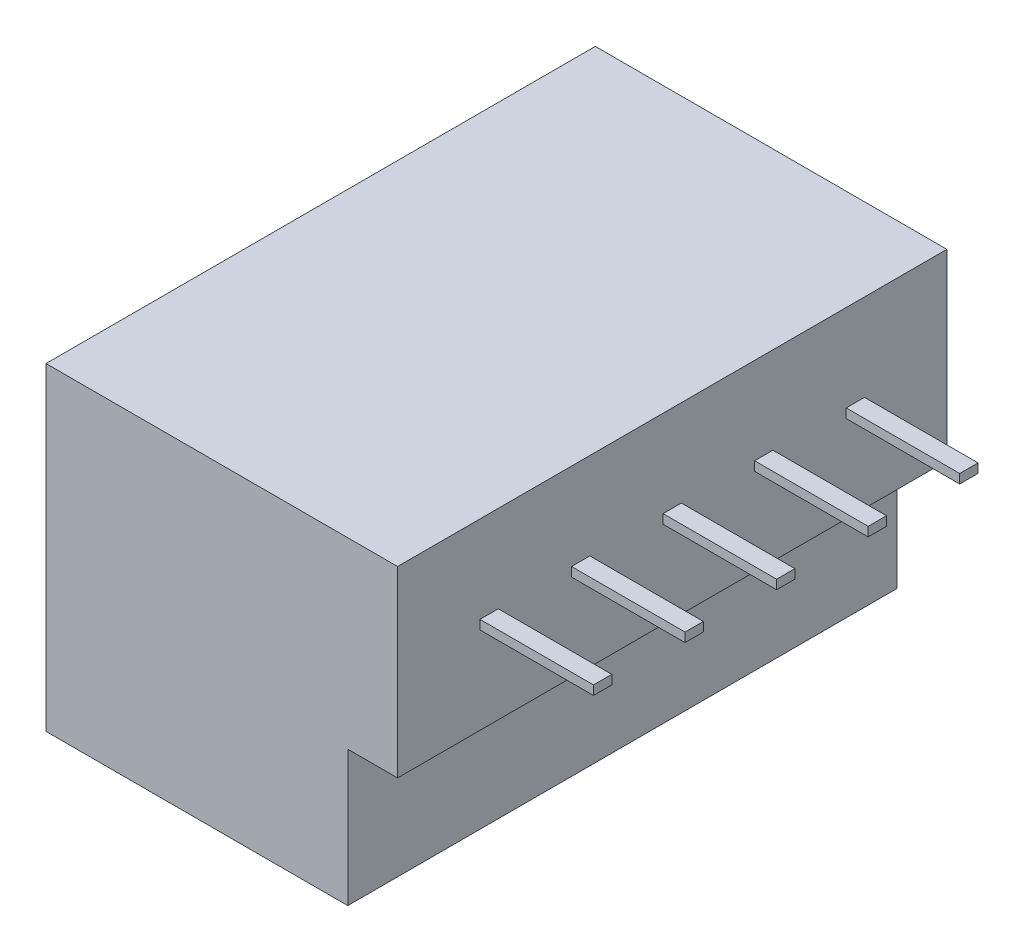
ISO-10303-21;
HEADER;
FILE_DESCRIPTION(('STEP AP214'),'2;1');
FILE_NAME('part.step','',(''),(''),'','','');
FILE_SCHEMA(('AUTOMOTIVE_DESIGN { 1 0 10303 214 1 1 1 1 }'));
ENDSEC;
DATA;
#1=APPLICATION_CONTEXT('core data for automotive mechanical design processes');
#2=APPLICATION_PROTOCOL_DEFINITION('international standard','automotive_design',2000,#1);
#3=PRODUCT_CONTEXT('',#1,'mechanical');
#4=PRODUCT('Part','Part','',(#3));
#5=PRODUCT_RELATED_PRODUCT_CATEGORY('part','',(#4));
#6=PRODUCT_DEFINITION_FORMATION('','',#4);
#7=PRODUCT_DEFINITION_CONTEXT('part definition',#1,'design');
#8=PRODUCT_DEFINITION('design','',#6,#7);
#9=PRODUCT_DEFINITION_SHAPE('','',#8);
#10=(LENGTH_UNIT() NAMED_UNIT(*) SI_UNIT(.MILLI.,.METRE.));
#11=(NAMED_UNIT(*) PLANE_ANGLE_UNIT() SI_UNIT($,.RADIAN.));
#12=(NAMED_UNIT(*) SI_UNIT($,.STERADIAN.) SOLID_ANGLE_UNIT());
#13=UNCERTAINTY_MEASURE_WITH_UNIT(LENGTH_MEASURE(1.E-05),#10,'distance_accuracy_value','');
#14=(GEOMETRIC_REPRESENTATION_CONTEXT(3) GLOBAL_UNCERTAINTY_ASSIGNED_CONTEXT((#13)) GLOBAL_UNIT_ASSIGNED_CONTEXT((#10,
#11,#12)) REPRESENTATION_CONTEXT('',''));
#15=CARTESIAN_POINT('',(0.,0.,0.));
#16=DIRECTION('',(0.,0.,1.));
#17=DIRECTION('',(1.,0.,0.));
#18=AXIS2_PLACEMENT_3D('',#15,#16,#17);
#19=CARTESIAN_POINT('',(-10.756881088162,8.7,-6.7780596006196));
#20=DIRECTION('',(-1.,0.,0.));
#21=DIRECTION('',(0.,0.,1.));
#22=AXIS2_PLACEMENT_3D('',#19,#20,#21);
#23=PLANE('',#22);
#24=DIRECTION('',(0.,-1.,0.));
#25=VECTOR('',#24,1.);
#26=CARTESIAN_POINT('',(-10.756881088162,6.325,-1.5280596006196));
#27=LINE('',#26,#25);
#28=CARTESIAN_POINT('',(-10.756881088162,6.325,-1.5280596006196));
#29=VERTEX_POINT('',#28);
#30=CARTESIAN_POINT('',(-10.756881088162,6.075,-1.5280596006196));
#31=VERTEX_POINT('',#30);
#32=EDGE_CURVE('E229',#29,#31,#27,.T.);
#33=ORIENTED_EDGE('',*,*,#32,.F.);
#34=DIRECTION('',(0.,0.,1.));
#35=VECTOR('',#34,1.);
#36=CARTESIAN_POINT('',(-10.756881088162,6.325,-1.5280596006196));
#37=LINE('',#36,#35);
#38=CARTESIAN_POINT('',(-10.756881088162,6.325,-2.0280596006196));
#39=VERTEX_POINT('',#38);
#40=EDGE_CURVE('E242',#39,#29,#37,.T.);
#41=ORIENTED_EDGE('',*,*,#40,.F.);
#42=DIRECTION('',(0.,1.,0.));
#43=VECTOR('',#42,1.);
#44=CARTESIAN_POINT('',(-10.756881088162,6.325,-2.0280596006196));
#45=LINE('',#44,#43);
#46=CARTESIAN_POINT('',(-10.756881088162,6.075,-2.0280596006196));
#47=VERTEX_POINT('',#46);
#48=EDGE_CURVE('E251',#47,#39,#45,.T.);
#49=ORIENTED_EDGE('',*,*,#48,.F.);
#50=DIRECTION('',(0.,0.,-1.));
#51=VECTOR('',#50,1.);
#52=CARTESIAN_POINT('',(-10.756881088162,6.075,-1.5280596006196));
#53=LINE('',#52,#51);
#54=EDGE_CURVE('E232',#31,#47,#53,.T.);
#55=ORIENTED_EDGE('',*,*,#54,.F.);
#56=EDGE_LOOP('',(#33,#41,#49,#55));
#57=FACE_BOUND('',#56,.T.);
#58=DIRECTION('',(0.,-1.,0.));
#59=VECTOR('',#58,1.);
#60=CARTESIAN_POINT('',(-10.756881088162,6.325,3.4719403993804));
#61=LINE('',#60,#59);
#62=CARTESIAN_POINT('',(-10.756881088162,6.325,3.4719403993804));
#63=VERTEX_POINT('',#62);
#64=CARTESIAN_POINT('',(-10.756881088162,6.075,3.4719403993804));
#65=VERTEX_POINT('',#64);
#66=EDGE_CURVE('E300',#63,#65,#61,.T.);
#67=ORIENTED_EDGE('',*,*,#66,.F.);
#68=DIRECTION('',(0.,0.,1.));
#69=VECTOR('',#68,1.);
#70=CARTESIAN_POINT('',(-10.756881088162,6.325,3.4719403993804));
#71=LINE('',#70,#69);
#72=CARTESIAN_POINT('',(-10.756881088162,6.325,2.9719403993804));
#73=VERTEX_POINT('',#72);
#74=EDGE_CURVE('E305',#73,#63,#71,.T.);
#75=ORIENTED_EDGE('',*,*,#74,.F.);
#76=DIRECTION('',(0.,1.,0.));
#77=VECTOR('',#76,1.);
#78=CARTESIAN_POINT('',(-10.756881088162,6.325,2.9719403993804));
#79=LINE('',#78,#77);
#80=CARTESIAN_POINT('',(-10.756881088162,6.075,2.9719403993804));
#81=VERTEX_POINT('',#80);
#82=EDGE_CURVE('E317',#81,#73,#79,.T.);
#83=ORIENTED_EDGE('',*,*,#82,.F.);
#84=DIRECTION('',(0.,0.,-1.));
#85=VECTOR('',#84,1.);
#86=CARTESIAN_POINT('',(-10.756881088162,6.075,3.4719403993804));
#87=LINE('',#86,#85);
#88=EDGE_CURVE('E314',#65,#81,#87,.T.);
#89=ORIENTED_EDGE('',*,*,#88,.F.);
#90=EDGE_LOOP('',(#67,#75,#83,#89));
#91=FACE_BOUND('',#90,.T.);
#92=DIRECTION('',(0.,0.,-1.));
#93=VECTOR('',#92,1.);
#94=CARTESIAN_POINT('',(-10.756881088162,3.7,-6.7780596006196));
#95=LINE('',#94,#93);
#96=CARTESIAN_POINT('',(-10.756881088162,3.7,8.2219403993804));
#97=VERTEX_POINT('',#96);
#98=CARTESIAN_POINT('',(-10.756881088162,3.7,-6.7780596006196));
#99=VERTEX_POINT('',#98);
#100=EDGE_CURVE('E381',#97,#99,#95,.T.);
#101=ORIENTED_EDGE('',*,*,#100,.T.);
#102=DIRECTION('',(0.,-1.,0.));
#103=VECTOR('',#102,1.);
#104=CARTESIAN_POINT('',(-10.756881088162,8.7,-6.7780596006196));
#105=LINE('',#104,#103);
#106=CARTESIAN_POINT('',(-10.756881088162,8.7,-6.7780596006196));
#107=VERTEX_POINT('',#106);
#108=EDGE_CURVE('E378',#107,#99,#105,.T.);
#109=ORIENTED_EDGE('',*,*,#108,.F.);
#110=DIRECTION('',(0.,0.,-1.));
#111=VECTOR('',#110,1.);
#112=CARTESIAN_POINT('',(-10.756881088162,8.7,-6.7780596006196));
#113=LINE('',#112,#111);
#114=CARTESIAN_POINT('',(-10.756881088162,8.7,8.2219403993804));
#115=VERTEX_POINT('',#114);
#116=EDGE_CURVE('E373',#115,#107,#113,.T.);
#117=ORIENTED_EDGE('',*,*,#116,.F.);
#118=DIRECTION('',(0.,-1.,0.));
#119=VECTOR('',#118,1.);
#120=CARTESIAN_POINT('',(-10.756881088162,8.7,8.2219403993804));
#121=LINE('',#120,#119);
#122=EDGE_CURVE('E416',#115,#97,#121,.T.);
#123=ORIENTED_EDGE('',*,*,#122,.T.);
#124=EDGE_LOOP('',(#101,#109,#117,#123));
#125=FACE_BOUND('',#124,.T.);
#126=DIRECTION('',(0.,-1.,0.));
#127=VECTOR('',#126,1.);
#128=CARTESIAN_POINT('',(-10.756881088162,6.325,5.9719403993804));
#129=LINE('',#128,#127);
#130=CARTESIAN_POINT('',(-10.756881088162,6.325,5.9719403993804));
#131=VERTEX_POINT('',#130);
#132=CARTESIAN_POINT('',(-10.756881088162,6.075,5.9719403993804));
#133=VERTEX_POINT('',#132);
#134=EDGE_CURVE('E333',#131,#133,#129,.T.);
#135=ORIENTED_EDGE('',*,*,#134,.F.);
#136=DIRECTION('',(0.,0.,1.));
#137=VECTOR('',#136,1.);
#138=CARTESIAN_POINT('',(-10.756881088162,6.325,5.9719403993804));
#139=LINE('',#138,#137);
#140=CARTESIAN_POINT('',(-10.756881088162,6.325,5.4719403993804));
#141=VERTEX_POINT('',#140);
#142=EDGE_CURVE('E338',#141,#131,#139,.T.);
#143=ORIENTED_EDGE('',*,*,#142,.F.);
#144=DIRECTION('',(0.,1.,0.));
#145=VECTOR('',#144,1.);
#146=CARTESIAN_POINT('',(-10.756881088162,6.325,5.4719403993804));
#147=LINE('',#146,#145);
#148=CARTESIAN_POINT('',(-10.756881088162,6.075,5.4719403993804));
#149=VERTEX_POINT('',#148);
#150=EDGE_CURVE('E350',#149,#141,#147,.T.);
#151=ORIENTED_EDGE('',*,*,#150,.F.);
#152=DIRECTION('',(0.,0.,-1.));
#153=VECTOR('',#152,1.);
#154=CARTESIAN_POINT('',(-10.756881088162,6.075,5.9719403993804));
#155=LINE('',#154,#153);
#156=EDGE_CURVE('E347',#133,#149,#155,.T.);
#157=ORIENTED_EDGE('',*,*,#156,.F.);
#158=EDGE_LOOP('',(#135,#143,#151,#157));
#159=FACE_BOUND('',#158,.T.);
#160=DIRECTION('',(0.,-1.,0.));
#161=VECTOR('',#160,1.);
#162=CARTESIAN_POINT('',(-10.756881088162,6.325,0.971940399380402));
#163=LINE('',#162,#161);
#164=CARTESIAN_POINT('',(-10.756881088162,6.325,0.971940399380402));
#165=VERTEX_POINT('',#164);
#166=CARTESIAN_POINT('',(-10.756881088162,6.075,0.971940399380402));
#167=VERTEX_POINT('',#166);
#168=EDGE_CURVE('E267',#165,#167,#163,.T.);
#169=ORIENTED_EDGE('',*,*,#168,.F.);
#170=DIRECTION('',(0.,0.,1.));
#171=VECTOR('',#170,1.);
#172=CARTESIAN_POINT('',(-10.756881088162,6.325,0.971940399380402));
#173=LINE('',#172,#171);
#174=CARTESIAN_POINT('',(-10.756881088162,6.325,0.471940399380401));
#175=VERTEX_POINT('',#174);
#176=EDGE_CURVE('E272',#175,#165,#173,.T.);
#177=ORIENTED_EDGE('',*,*,#176,.F.);
#178=DIRECTION('',(0.,1.,0.));
#179=VECTOR('',#178,1.);
#180=CARTESIAN_POINT('',(-10.756881088162,6.325,0.471940399380402));
#181=LINE('',#180,#179);
#182=CARTESIAN_POINT('',(-10.756881088162,6.075,0.471940399380402));
#183=VERTEX_POINT('',#182);
#184=EDGE_CURVE('E284',#183,#175,#181,.T.);
#185=ORIENTED_EDGE('',*,*,#184,.F.);
#186=DIRECTION('',(0.,0.,-1.));
#187=VECTOR('',#186,1.);
#188=CARTESIAN_POINT('',(-10.756881088162,6.075,0.971940399380402));
#189=LINE('',#188,#187);
#190=EDGE_CURVE('E281',#167,#183,#189,.T.);
#191=ORIENTED_EDGE('',*,*,#190,.F.);
#192=EDGE_LOOP('',(#169,#177,#185,#191));
#193=FACE_BOUND('',#192,.T.);
#194=DIRECTION('',(0.,-1.,0.));
#195=VECTOR('',#194,1.);
#196=CARTESIAN_POINT('',(-10.756881088162,6.325,-4.0280596006196));
#197=LINE('',#196,#195);
#198=CARTESIAN_POINT('',(-10.756881088162,6.325,-4.0280596006196));
#199=VERTEX_POINT('',#198);
#200=CARTESIAN_POINT('',(-10.756881088162,6.075,-4.0280596006196));
#201=VERTEX_POINT('',#200);
#202=EDGE_CURVE('E228',#199,#201,#197,.T.);
#203=ORIENTED_EDGE('',*,*,#202,.F.);
#204=DIRECTION('',(0.,0.,1.));
#205=VECTOR('',#204,1.);
#206=CARTESIAN_POINT('',(-10.756881088162,6.325,-4.0280596006196));
#207=LINE('',#206,#205);
#208=CARTESIAN_POINT('',(-10.756881088162,6.325,-4.5280596006196));
#209=VERTEX_POINT('',#208);
#210=EDGE_CURVE('E225',#209,#199,#207,.T.);
#211=ORIENTED_EDGE('',*,*,#210,.F.);
#212=DIRECTION('',(0.,1.,0.));
#213=VECTOR('',#212,1.);
#214=CARTESIAN_POINT('',(-10.756881088162,6.325,-4.5280596006196));
#215=LINE('',#214,#213);
#216=CARTESIAN_POINT('',(-10.756881088162,6.075,-4.5280596006196));
#217=VERTEX_POINT('',#216);
#218=EDGE_CURVE('E55',#217,#209,#215,.T.);
#219=ORIENTED_EDGE('',*,*,#218,.F.);
#220=DIRECTION('',(0.,0.,-1.));
#221=VECTOR('',#220,1.);
#222=CARTESIAN_POINT('',(-10.756881088162,6.075,-4.0280596006196));
#223=LINE('',#222,#221);
#224=EDGE_CURVE('E50',#201,#217,#223,.T.);
#225=ORIENTED_EDGE('',*,*,#224,.F.);
#226=EDGE_LOOP('',(#203,#211,#219,#225));
#227=FACE_BOUND('',#226,.T.);
#228=ADVANCED_FACE('F33',(#57,#91,#125,#159,#193,#227),#23,.F.);
#229=CARTESIAN_POINT('',(-20.356881088162,3.7,-6.7780596006196));
#230=DIRECTION('',(1.,0.,0.));
#231=DIRECTION('',(0.,0.,-1.));
#232=AXIS2_PLACEMENT_3D('',#229,#230,#231);
#233=PLANE('',#232);
#234=DIRECTION('',(0.,0.,1.));
#235=VECTOR('',#234,1.);
#236=CARTESIAN_POINT('',(-20.356881088162,0.,-6.7780596006196));
#237=LINE('',#236,#235);
#238=CARTESIAN_POINT('',(-20.356881088162,0.,-6.7780596006196));
#239=VERTEX_POINT('',#238);
#240=CARTESIAN_POINT('',(-20.356881088162,0.,8.2219403993804));
#241=VERTEX_POINT('',#240);
#242=EDGE_CURVE('E389',#239,#241,#237,.T.);
#243=ORIENTED_EDGE('',*,*,#242,.T.);
#244=DIRECTION('',(0.,-1.,0.));
#245=VECTOR('',#244,1.);
#246=CARTESIAN_POINT('',(-20.356881088162,3.7,8.2219403993804));
#247=LINE('',#246,#245);
#248=CARTESIAN_POINT('',(-20.356881088162,8.7,8.2219403993804));
#249=VERTEX_POINT('',#248);
#250=EDGE_CURVE('E11',#249,#241,#247,.T.);
#251=ORIENTED_EDGE('',*,*,#250,.F.);
#252=DIRECTION('',(0.,0.,1.));
#253=VECTOR('',#252,1.);
#254=CARTESIAN_POINT('',(-20.356881088162,8.7,8.2219403993804));
#255=LINE('',#254,#253);
#256=CARTESIAN_POINT('',(-20.356881088162,8.7,-6.7780596006196));
#257=VERTEX_POINT('',#256);
#258=EDGE_CURVE('E367',#257,#249,#255,.T.);
#259=ORIENTED_EDGE('',*,*,#258,.F.);
#260=DIRECTION('',(0.,-1.,0.));
#261=VECTOR('',#260,1.);
#262=CARTESIAN_POINT('',(-20.356881088162,3.7,-6.7780596006196));
#263=LINE('',#262,#261);
#264=EDGE_CURVE('E395',#257,#239,#263,.T.);
#265=ORIENTED_EDGE('',*,*,#264,.T.);
#266=EDGE_LOOP('',(#243,#251,#259,#265));
#267=FACE_BOUND('',#266,.T.);
#268=ADVANCED_FACE('F35',(#267),#233,.F.);
#269=CARTESIAN_POINT('',(-20.356881088162,3.7,8.2219403993804));
#270=DIRECTION('',(0.,0.,-1.));
#271=DIRECTION('',(-1.,0.,0.));
#272=AXIS2_PLACEMENT_3D('',#269,#270,#271);
#273=PLANE('',#272);
#274=DIRECTION('',(1.,0.,0.));
#275=VECTOR('',#274,1.);
#276=CARTESIAN_POINT('',(-20.356881088162,0.,8.2219403993804));
#277=LINE('',#276,#275);
#278=CARTESIAN_POINT('',(-12.116881088162,0.,8.2219403993804));
#279=VERTEX_POINT('',#278);
#280=EDGE_CURVE('E413',#241,#279,#277,.T.);
#281=ORIENTED_EDGE('',*,*,#280,.T.);
#282=DIRECTION('',(0.,-1.,0.));
#283=VECTOR('',#282,1.);
#284=CARTESIAN_POINT('',(-12.116881088162,3.7,8.2219403993804));
#285=LINE('',#284,#283);
#286=CARTESIAN_POINT('',(-12.116881088162,3.7,8.2219403993804));
#287=VERTEX_POINT('',#286);
#288=EDGE_CURVE('E42',#287,#279,#285,.T.);
#289=ORIENTED_EDGE('',*,*,#288,.F.);
#290=DIRECTION('',(1.,0.,0.));
#291=VECTOR('',#290,1.);
#292=CARTESIAN_POINT('',(-12.116881088162,3.7,8.2219403993804));
#293=LINE('',#292,#291);
#294=EDGE_CURVE('E366',#287,#97,#293,.T.);
#295=ORIENTED_EDGE('',*,*,#294,.T.);
#296=ORIENTED_EDGE('',*,*,#122,.F.);
#297=DIRECTION('',(1.,0.,0.));
#298=VECTOR('',#297,1.);
#299=CARTESIAN_POINT('',(-20.356881088162,8.7,8.2219403993804));
#300=LINE('',#299,#298);
#301=EDGE_CURVE('E370',#249,#115,#300,.T.);
#302=ORIENTED_EDGE('',*,*,#301,.F.);
#303=ORIENTED_EDGE('',*,*,#250,.T.);
#304=EDGE_LOOP('',(#281,#289,#295,#296,#302,#303));
#305=FACE_BOUND('',#304,.T.);
#306=ADVANCED_FACE('F442',(#305),#273,.F.);
#307=CARTESIAN_POINT('',(-12.116881088162,3.7,-6.7780596006196));
#308=DIRECTION('',(-1.,0.,0.));
#309=DIRECTION('',(0.,0.,1.));
#310=AXIS2_PLACEMENT_3D('',#307,#308,#309);
#311=PLANE('',#310);
#312=DIRECTION('',(0.,0.,-1.));
#313=VECTOR('',#312,1.);
#314=CARTESIAN_POINT('',(-12.116881088162,0.,-6.7780596006196));
#315=LINE('',#314,#313);
#316=CARTESIAN_POINT('',(-12.116881088162,0.,-6.7780596006196));
#317=VERTEX_POINT('',#316);
#318=EDGE_CURVE('E412',#279,#317,#315,.T.);
#319=ORIENTED_EDGE('',*,*,#318,.T.);
#320=DIRECTION('',(0.,-1.,0.));
#321=VECTOR('',#320,1.);
#322=CARTESIAN_POINT('',(-12.116881088162,3.7,-6.7780596006196));
#323=LINE('',#322,#321);
#324=CARTESIAN_POINT('',(-12.116881088162,3.7,-6.7780596006196));
#325=VERTEX_POINT('',#324);
#326=EDGE_CURVE('E400',#325,#317,#323,.T.);
#327=ORIENTED_EDGE('',*,*,#326,.F.);
#328=DIRECTION('',(0.,0.,-1.));
#329=VECTOR('',#328,1.);
#330=CARTESIAN_POINT('',(-12.116881088162,3.7,-6.7780596006196));
#331=LINE('',#330,#329);
#332=EDGE_CURVE('E392',#287,#325,#331,.T.);
#333=ORIENTED_EDGE('',*,*,#332,.F.);
#334=ORIENTED_EDGE('',*,*,#288,.T.);
#335=EDGE_LOOP('',(#319,#327,#333,#334));
#336=FACE_BOUND('',#335,.T.);
#337=ADVANCED_FACE('F435',(#336),#311,.F.);
#338=CARTESIAN_POINT('',(-20.356881088162,3.7,-6.7780596006196));
#339=DIRECTION('',(0.,0.,1.));
#340=DIRECTION('',(1.,0.,0.));
#341=AXIS2_PLACEMENT_3D('',#338,#339,#340);
#342=PLANE('',#341);
#343=DIRECTION('',(-1.,0.,0.));
#344=VECTOR('',#343,1.);
#345=CARTESIAN_POINT('',(-20.356881088162,0.,-6.7780596006196));
#346=LINE('',#345,#344);
#347=EDGE_CURVE('E396',#317,#239,#346,.T.);
#348=ORIENTED_EDGE('',*,*,#347,.T.);
#349=ORIENTED_EDGE('',*,*,#264,.F.);
#350=DIRECTION('',(-1.,0.,0.));
#351=VECTOR('',#350,1.);
#352=CARTESIAN_POINT('',(-12.116881088162,8.7,-6.7780596006196));
#353=LINE('',#352,#351);
#354=EDGE_CURVE('E375',#107,#257,#353,.T.);
#355=ORIENTED_EDGE('',*,*,#354,.F.);
#356=ORIENTED_EDGE('',*,*,#108,.T.);
#357=DIRECTION('',(-1.,0.,0.));
#358=VECTOR('',#357,1.);
#359=CARTESIAN_POINT('',(-20.356881088162,3.7,-6.7780596006196));
#360=LINE('',#359,#358);
#361=EDGE_CURVE('E371',#99,#325,#360,.T.);
#362=ORIENTED_EDGE('',*,*,#361,.T.);
#363=ORIENTED_EDGE('',*,*,#326,.T.);
#364=EDGE_LOOP('',(#348,#349,#355,#356,#362,#363));
#365=FACE_BOUND('',#364,.T.);
#366=ADVANCED_FACE('F430',(#365),#342,.F.);
#367=CARTESIAN_POINT('',(0.,0.,0.));
#368=DIRECTION('',(0.,1.,0.));
#369=DIRECTION('',(0.,0.,1.));
#370=AXIS2_PLACEMENT_3D('',#367,#368,#369);
#371=PLANE('',#370);
#372=ORIENTED_EDGE('',*,*,#242,.F.);
#373=ORIENTED_EDGE('',*,*,#347,.F.);
#374=ORIENTED_EDGE('',*,*,#318,.F.);
#375=ORIENTED_EDGE('',*,*,#280,.F.);
#376=EDGE_LOOP('',(#372,#373,#374,#375));
#377=FACE_BOUND('',#376,.T.);
#378=ADVANCED_FACE('F437',(#377),#371,.F.);
#379=CARTESIAN_POINT('',(0.,8.7,0.));
#380=DIRECTION('',(0.,-1.,0.));
#381=DIRECTION('',(0.,0.,-1.));
#382=AXIS2_PLACEMENT_3D('',#379,#380,#381);
#383=PLANE('',#382);
#384=ORIENTED_EDGE('',*,*,#258,.T.);
#385=ORIENTED_EDGE('',*,*,#301,.T.);
#386=ORIENTED_EDGE('',*,*,#116,.T.);
#387=ORIENTED_EDGE('',*,*,#354,.T.);
#388=EDGE_LOOP('',(#384,#385,#386,#387));
#389=FACE_BOUND('',#388,.T.);
#390=ADVANCED_FACE('F441',(#389),#383,.F.);
#391=CARTESIAN_POINT('',(0.,3.7,0.));
#392=DIRECTION('',(0.,-1.,0.));
#393=DIRECTION('',(0.,0.,-1.));
#394=AXIS2_PLACEMENT_3D('',#391,#392,#393);
#395=PLANE('',#394);
#396=ORIENTED_EDGE('',*,*,#294,.F.);
#397=ORIENTED_EDGE('',*,*,#332,.T.);
#398=ORIENTED_EDGE('',*,*,#361,.F.);
#399=ORIENTED_EDGE('',*,*,#100,.F.);
#400=EDGE_LOOP('',(#396,#397,#398,#399));
#401=FACE_BOUND('',#400,.T.);
#402=ADVANCED_FACE('F434',(#401),#395,.T.);
#403=CARTESIAN_POINT('',(-7.65688108816203,6.325,5.9719403993804));
#404=DIRECTION('',(0.,0.,-1.));
#405=DIRECTION('',(-1.,0.,0.));
#406=AXIS2_PLACEMENT_3D('',#403,#404,#405);
#407=PLANE('',#406);
#408=ORIENTED_EDGE('',*,*,#134,.T.);
#409=DIRECTION('',(-1.,0.,0.));
#410=VECTOR('',#409,1.);
#411=CARTESIAN_POINT('',(-7.65688108816203,6.075,5.9719403993804));
#412=LINE('',#411,#410);
#413=CARTESIAN_POINT('',(-7.65688108816203,6.075,5.9719403993804));
#414=VERTEX_POINT('',#413);
#415=EDGE_CURVE('E363',#414,#133,#412,.T.);
#416=ORIENTED_EDGE('',*,*,#415,.F.);
#417=DIRECTION('',(0.,-1.,0.));
#418=VECTOR('',#417,1.);
#419=CARTESIAN_POINT('',(-7.65688108816203,6.325,5.9719403993804));
#420=LINE('',#419,#418);
#421=CARTESIAN_POINT('',(-7.65688108816203,6.325,5.9719403993804));
#422=VERTEX_POINT('',#421);
#423=EDGE_CURVE('E334',#422,#414,#420,.T.);
#424=ORIENTED_EDGE('',*,*,#423,.F.);
#425=DIRECTION('',(-1.,0.,0.));
#426=VECTOR('',#425,1.);
#427=CARTESIAN_POINT('',(-7.65688108816203,6.325,5.9719403993804));
#428=LINE('',#427,#426);
#429=EDGE_CURVE('E344',#422,#131,#428,.T.);
#430=ORIENTED_EDGE('',*,*,#429,.T.);
#431=EDGE_LOOP('',(#408,#416,#424,#430));
#432=FACE_BOUND('',#431,.T.);
#433=ADVANCED_FACE('F481',(#432),#407,.F.);
#434=CARTESIAN_POINT('',(-7.65688108816203,6.075,5.9719403993804));
#435=DIRECTION('',(0.,1.,0.));
#436=DIRECTION('',(0.,0.,1.));
#437=AXIS2_PLACEMENT_3D('',#434,#435,#436);
#438=PLANE('',#437);
#439=ORIENTED_EDGE('',*,*,#156,.T.);
#440=DIRECTION('',(-1.,0.,0.));
#441=VECTOR('',#440,1.);
#442=CARTESIAN_POINT('',(-7.65688108816203,6.075,5.4719403993804));
#443=LINE('',#442,#441);
#444=CARTESIAN_POINT('',(-7.65688108816203,6.075,5.4719403993804));
#445=VERTEX_POINT('',#444);
#446=EDGE_CURVE('E360',#445,#149,#443,.T.);
#447=ORIENTED_EDGE('',*,*,#446,.F.);
#448=DIRECTION('',(0.,0.,-1.));
#449=VECTOR('',#448,1.);
#450=CARTESIAN_POINT('',(-7.65688108816203,6.075,5.9719403993804));
#451=LINE('',#450,#449);
#452=EDGE_CURVE('E337',#414,#445,#451,.T.);
#453=ORIENTED_EDGE('',*,*,#452,.F.);
#454=ORIENTED_EDGE('',*,*,#415,.T.);
#455=EDGE_LOOP('',(#439,#447,#453,#454));
#456=FACE_BOUND('',#455,.T.);
#457=ADVANCED_FACE('F487',(#456),#438,.F.);
#458=CARTESIAN_POINT('',(-7.65688108816203,6.325,5.4719403993804));
#459=DIRECTION('',(0.,0.,1.));
#460=DIRECTION('',(1.,0.,0.));
#461=AXIS2_PLACEMENT_3D('',#458,#459,#460);
#462=PLANE('',#461);
#463=ORIENTED_EDGE('',*,*,#150,.T.);
#464=DIRECTION('',(-1.,0.,0.));
#465=VECTOR('',#464,1.);
#466=CARTESIAN_POINT('',(-7.65688108816203,6.325,5.4719403993804));
#467=LINE('',#466,#465);
#468=CARTESIAN_POINT('',(-7.65688108816203,6.325,5.4719403993804));
#469=VERTEX_POINT('',#468);
#470=EDGE_CURVE('E357',#469,#141,#467,.T.);
#471=ORIENTED_EDGE('',*,*,#470,.F.);
#472=DIRECTION('',(0.,1.,0.));
#473=VECTOR('',#472,1.);
#474=CARTESIAN_POINT('',(-7.65688108816203,6.325,5.4719403993804));
#475=LINE('',#474,#473);
#476=EDGE_CURVE('E340',#445,#469,#475,.T.);
#477=ORIENTED_EDGE('',*,*,#476,.F.);
#478=ORIENTED_EDGE('',*,*,#446,.T.);
#479=EDGE_LOOP('',(#463,#471,#477,#478));
#480=FACE_BOUND('',#479,.T.);
#481=ADVANCED_FACE('F495',(#480),#462,.F.);
#482=CARTESIAN_POINT('',(-7.65688108816203,6.325,5.9719403993804));
#483=DIRECTION('',(0.,-1.,0.));
#484=DIRECTION('',(0.,0.,-1.));
#485=AXIS2_PLACEMENT_3D('',#482,#483,#484);
#486=PLANE('',#485);
#487=ORIENTED_EDGE('',*,*,#142,.T.);
#488=ORIENTED_EDGE('',*,*,#429,.F.);
#489=DIRECTION('',(0.,0.,1.));
#490=VECTOR('',#489,1.);
#491=CARTESIAN_POINT('',(-7.65688108816203,6.325,5.9719403993804));
#492=LINE('',#491,#490);
#493=EDGE_CURVE('E342',#469,#422,#492,.T.);
#494=ORIENTED_EDGE('',*,*,#493,.F.);
#495=ORIENTED_EDGE('',*,*,#470,.T.);
#496=EDGE_LOOP('',(#487,#488,#494,#495));
#497=FACE_BOUND('',#496,.T.);
#498=ADVANCED_FACE('F503',(#497),#486,.F.);
#499=CARTESIAN_POINT('',(-7.65688108816203,0.,0.));
#500=DIRECTION('',(1.,0.,0.));
#501=DIRECTION('',(0.,0.,-1.));
#502=AXIS2_PLACEMENT_3D('',#499,#500,#501);
#503=PLANE('',#502);
#504=ORIENTED_EDGE('',*,*,#423,.T.);
#505=ORIENTED_EDGE('',*,*,#452,.T.);
#506=ORIENTED_EDGE('',*,*,#476,.T.);
#507=ORIENTED_EDGE('',*,*,#493,.T.);
#508=EDGE_LOOP('',(#504,#505,#506,#507));
#509=FACE_BOUND('',#508,.T.);
#510=ADVANCED_FACE('F511',(#509),#503,.T.);
#511=CARTESIAN_POINT('',(-7.65688108816203,6.325,3.4719403993804));
#512=DIRECTION('',(0.,0.,-1.));
#513=DIRECTION('',(-1.,0.,0.));
#514=AXIS2_PLACEMENT_3D('',#511,#512,#513);
#515=PLANE('',#514);
#516=ORIENTED_EDGE('',*,*,#66,.T.);
#517=DIRECTION('',(-1.,0.,0.));
#518=VECTOR('',#517,1.);
#519=CARTESIAN_POINT('',(-7.65688108816203,6.075,3.4719403993804));
#520=LINE('',#519,#518);
#521=CARTESIAN_POINT('',(-7.65688108816203,6.075,3.4719403993804));
#522=VERTEX_POINT('',#521);
#523=EDGE_CURVE('E330',#522,#65,#520,.T.);
#524=ORIENTED_EDGE('',*,*,#523,.F.);
#525=DIRECTION('',(0.,-1.,0.));
#526=VECTOR('',#525,1.);
#527=CARTESIAN_POINT('',(-7.65688108816203,6.325,3.4719403993804));
#528=LINE('',#527,#526);
#529=CARTESIAN_POINT('',(-7.65688108816203,6.325,3.4719403993804));
#530=VERTEX_POINT('',#529);
#531=EDGE_CURVE('E301',#530,#522,#528,.T.);
#532=ORIENTED_EDGE('',*,*,#531,.F.);
#533=DIRECTION('',(-1.,0.,0.));
#534=VECTOR('',#533,1.);
#535=CARTESIAN_POINT('',(-7.65688108816203,6.325,3.4719403993804));
#536=LINE('',#535,#534);
#537=EDGE_CURVE('E311',#530,#63,#536,.T.);
#538=ORIENTED_EDGE('',*,*,#537,.T.);
#539=EDGE_LOOP('',(#516,#524,#532,#538));
#540=FACE_BOUND('',#539,.T.);
#541=ADVANCED_FACE('F519',(#540),#515,.F.);
#542=CARTESIAN_POINT('',(-7.65688108816203,6.075,3.4719403993804));
#543=DIRECTION('',(0.,1.,0.));
#544=DIRECTION('',(0.,0.,1.));
#545=AXIS2_PLACEMENT_3D('',#542,#543,#544);
#546=PLANE('',#545);
#547=ORIENTED_EDGE('',*,*,#88,.T.);
#548=DIRECTION('',(-1.,0.,0.));
#549=VECTOR('',#548,1.);
#550=CARTESIAN_POINT('',(-7.65688108816203,6.075,2.9719403993804));
#551=LINE('',#550,#549);
#552=CARTESIAN_POINT('',(-7.65688108816203,6.075,2.9719403993804));
#553=VERTEX_POINT('',#552);
#554=EDGE_CURVE('E327',#553,#81,#551,.T.);
#555=ORIENTED_EDGE('',*,*,#554,.F.);
#556=DIRECTION('',(0.,0.,-1.));
#557=VECTOR('',#556,1.);
#558=CARTESIAN_POINT('',(-7.65688108816203,6.075,3.4719403993804));
#559=LINE('',#558,#557);
#560=EDGE_CURVE('E304',#522,#553,#559,.T.);
#561=ORIENTED_EDGE('',*,*,#560,.F.);
#562=ORIENTED_EDGE('',*,*,#523,.T.);
#563=EDGE_LOOP('',(#547,#555,#561,#562));
#564=FACE_BOUND('',#563,.T.);
#565=ADVANCED_FACE('F527',(#564),#546,.F.);
#566=CARTESIAN_POINT('',(-7.65688108816203,6.325,2.9719403993804));
#567=DIRECTION('',(0.,0.,1.));
#568=DIRECTION('',(1.,0.,0.));
#569=AXIS2_PLACEMENT_3D('',#566,#567,#568);
#570=PLANE('',#569);
#571=ORIENTED_EDGE('',*,*,#82,.T.);
#572=DIRECTION('',(-1.,0.,0.));
#573=VECTOR('',#572,1.);
#574=CARTESIAN_POINT('',(-7.65688108816203,6.325,2.9719403993804));
#575=LINE('',#574,#573);
#576=CARTESIAN_POINT('',(-7.65688108816203,6.325,2.9719403993804));
#577=VERTEX_POINT('',#576);
#578=EDGE_CURVE('E324',#577,#73,#575,.T.);
#579=ORIENTED_EDGE('',*,*,#578,.F.);
#580=DIRECTION('',(0.,1.,0.));
#581=VECTOR('',#580,1.);
#582=CARTESIAN_POINT('',(-7.65688108816203,6.325,2.9719403993804));
#583=LINE('',#582,#581);
#584=EDGE_CURVE('E307',#553,#577,#583,.T.);
#585=ORIENTED_EDGE('',*,*,#584,.F.);
#586=ORIENTED_EDGE('',*,*,#554,.T.);
#587=EDGE_LOOP('',(#571,#579,#585,#586));
#588=FACE_BOUND('',#587,.T.);
#589=ADVANCED_FACE('F535',(#588),#570,.F.);
#590=CARTESIAN_POINT('',(-7.65688108816203,6.325,3.4719403993804));
#591=DIRECTION('',(0.,-1.,0.));
#592=DIRECTION('',(0.,0.,-1.));
#593=AXIS2_PLACEMENT_3D('',#590,#591,#592);
#594=PLANE('',#593);
#595=ORIENTED_EDGE('',*,*,#74,.T.);
#596=ORIENTED_EDGE('',*,*,#537,.F.);
#597=DIRECTION('',(0.,0.,1.));
#598=VECTOR('',#597,1.);
#599=CARTESIAN_POINT('',(-7.65688108816203,6.325,3.4719403993804));
#600=LINE('',#599,#598);
#601=EDGE_CURVE('E309',#577,#530,#600,.T.);
#602=ORIENTED_EDGE('',*,*,#601,.F.);
#603=ORIENTED_EDGE('',*,*,#578,.T.);
#604=EDGE_LOOP('',(#595,#596,#602,#603));
#605=FACE_BOUND('',#604,.T.);
#606=ADVANCED_FACE('F543',(#605),#594,.F.);
#607=CARTESIAN_POINT('',(-7.65688108816203,0.,0.));
#608=DIRECTION('',(1.,0.,0.));
#609=DIRECTION('',(0.,0.,-1.));
#610=AXIS2_PLACEMENT_3D('',#607,#608,#609);
#611=PLANE('',#610);
#612=ORIENTED_EDGE('',*,*,#531,.T.);
#613=ORIENTED_EDGE('',*,*,#560,.T.);
#614=ORIENTED_EDGE('',*,*,#584,.T.);
#615=ORIENTED_EDGE('',*,*,#601,.T.);
#616=EDGE_LOOP('',(#612,#613,#614,#615));
#617=FACE_BOUND('',#616,.T.);
#618=ADVANCED_FACE('F551',(#617),#611,.T.);
#619=CARTESIAN_POINT('',(-7.65688108816203,6.325,0.971940399380401));
#620=DIRECTION('',(0.,0.,-1.));
#621=DIRECTION('',(-1.,0.,0.));
#622=AXIS2_PLACEMENT_3D('',#619,#620,#621);
#623=PLANE('',#622);
#624=ORIENTED_EDGE('',*,*,#168,.T.);
#625=DIRECTION('',(-1.,0.,0.));
#626=VECTOR('',#625,1.);
#627=CARTESIAN_POINT('',(-7.65688108816203,6.075,0.971940399380401));
#628=LINE('',#627,#626);
#629=CARTESIAN_POINT('',(-7.65688108816203,6.075,0.971940399380401));
#630=VERTEX_POINT('',#629);
#631=EDGE_CURVE('E297',#630,#167,#628,.T.);
#632=ORIENTED_EDGE('',*,*,#631,.F.);
#633=DIRECTION('',(0.,-1.,0.));
#634=VECTOR('',#633,1.);
#635=CARTESIAN_POINT('',(-7.65688108816203,6.325,0.971940399380401));
#636=LINE('',#635,#634);
#637=CARTESIAN_POINT('',(-7.65688108816203,6.325,0.971940399380401));
#638=VERTEX_POINT('',#637);
#639=EDGE_CURVE('E268',#638,#630,#636,.T.);
#640=ORIENTED_EDGE('',*,*,#639,.F.);
#641=DIRECTION('',(-1.,0.,0.));
#642=VECTOR('',#641,1.);
#643=CARTESIAN_POINT('',(-7.65688108816203,6.325,0.971940399380401));
#644=LINE('',#643,#642);
#645=EDGE_CURVE('E278',#638,#165,#644,.T.);
#646=ORIENTED_EDGE('',*,*,#645,.T.);
#647=EDGE_LOOP('',(#624,#632,#640,#646));
#648=FACE_BOUND('',#647,.T.);
#649=ADVANCED_FACE('F559',(#648),#623,.F.);
#650=CARTESIAN_POINT('',(-7.65688108816203,6.075,0.971940399380401));
#651=DIRECTION('',(0.,1.,0.));
#652=DIRECTION('',(0.,0.,1.));
#653=AXIS2_PLACEMENT_3D('',#650,#651,#652);
#654=PLANE('',#653);
#655=ORIENTED_EDGE('',*,*,#190,.T.);
#656=DIRECTION('',(-1.,0.,0.));
#657=VECTOR('',#656,1.);
#658=CARTESIAN_POINT('',(-7.65688108816203,6.075,0.471940399380401));
#659=LINE('',#658,#657);
#660=CARTESIAN_POINT('',(-7.65688108816203,6.075,0.471940399380401));
#661=VERTEX_POINT('',#660);
#662=EDGE_CURVE('E294',#661,#183,#659,.T.);
#663=ORIENTED_EDGE('',*,*,#662,.F.);
#664=DIRECTION('',(0.,0.,-1.));
#665=VECTOR('',#664,1.);
#666=CARTESIAN_POINT('',(-7.65688108816203,6.075,0.971940399380401));
#667=LINE('',#666,#665);
#668=EDGE_CURVE('E271',#630,#661,#667,.T.);
#669=ORIENTED_EDGE('',*,*,#668,.F.);
#670=ORIENTED_EDGE('',*,*,#631,.T.);
#671=EDGE_LOOP('',(#655,#663,#669,#670));
#672=FACE_BOUND('',#671,.T.);
#673=ADVANCED_FACE('F567',(#672),#654,.F.);
#674=CARTESIAN_POINT('',(-7.65688108816203,6.325,0.471940399380401));
#675=DIRECTION('',(0.,0.,1.));
#676=DIRECTION('',(1.,0.,0.));
#677=AXIS2_PLACEMENT_3D('',#674,#675,#676);
#678=PLANE('',#677);
#679=ORIENTED_EDGE('',*,*,#184,.T.);
#680=DIRECTION('',(-1.,0.,0.));
#681=VECTOR('',#680,1.);
#682=CARTESIAN_POINT('',(-7.65688108816203,6.325,0.471940399380401));
#683=LINE('',#682,#681);
#684=CARTESIAN_POINT('',(-7.65688108816203,6.325,0.471940399380401));
#685=VERTEX_POINT('',#684);
#686=EDGE_CURVE('E291',#685,#175,#683,.T.);
#687=ORIENTED_EDGE('',*,*,#686,.F.);
#688=DIRECTION('',(0.,1.,0.));
#689=VECTOR('',#688,1.);
#690=CARTESIAN_POINT('',(-7.65688108816203,6.325,0.471940399380401));
#691=LINE('',#690,#689);
#692=EDGE_CURVE('E274',#661,#685,#691,.T.);
#693=ORIENTED_EDGE('',*,*,#692,.F.);
#694=ORIENTED_EDGE('',*,*,#662,.T.);
#695=EDGE_LOOP('',(#679,#687,#693,#694));
#696=FACE_BOUND('',#695,.T.);
#697=ADVANCED_FACE('F575',(#696),#678,.F.);
#698=CARTESIAN_POINT('',(-7.65688108816203,6.325,0.971940399380401));
#699=DIRECTION('',(0.,-1.,0.));
#700=DIRECTION('',(0.,0.,-1.));
#701=AXIS2_PLACEMENT_3D('',#698,#699,#700);
#702=PLANE('',#701);
#703=ORIENTED_EDGE('',*,*,#176,.T.);
#704=ORIENTED_EDGE('',*,*,#645,.F.);
#705=DIRECTION('',(0.,0.,1.));
#706=VECTOR('',#705,1.);
#707=CARTESIAN_POINT('',(-7.65688108816203,6.325,0.971940399380401));
#708=LINE('',#707,#706);
#709=EDGE_CURVE('E276',#685,#638,#708,.T.);
#710=ORIENTED_EDGE('',*,*,#709,.F.);
#711=ORIENTED_EDGE('',*,*,#686,.T.);
#712=EDGE_LOOP('',(#703,#704,#710,#711));
#713=FACE_BOUND('',#712,.T.);
#714=ADVANCED_FACE('F583',(#713),#702,.F.);
#715=CARTESIAN_POINT('',(-7.65688108816203,0.,0.));
#716=DIRECTION('',(1.,0.,0.));
#717=DIRECTION('',(0.,0.,-1.));
#718=AXIS2_PLACEMENT_3D('',#715,#716,#717);
#719=PLANE('',#718);
#720=ORIENTED_EDGE('',*,*,#639,.T.);
#721=ORIENTED_EDGE('',*,*,#668,.T.);
#722=ORIENTED_EDGE('',*,*,#692,.T.);
#723=ORIENTED_EDGE('',*,*,#709,.T.);
#724=EDGE_LOOP('',(#720,#721,#722,#723));
#725=FACE_BOUND('',#724,.T.);
#726=ADVANCED_FACE('F591',(#725),#719,.T.);
#727=CARTESIAN_POINT('',(-7.65688108816203,6.325,-1.5280596006196));
#728=DIRECTION('',(0.,0.,-1.));
#729=DIRECTION('',(0.,1.,0.));
#730=AXIS2_PLACEMENT_3D('',#727,#728,#729);
#731=PLANE('',#730);
#732=ORIENTED_EDGE('',*,*,#32,.T.);
#733=DIRECTION('',(-1.,0.,0.));
#734=VECTOR('',#733,1.);
#735=CARTESIAN_POINT('',(-7.65688108816203,6.075,-1.5280596006196));
#736=LINE('',#735,#734);
#737=CARTESIAN_POINT('',(-7.65688108816203,6.075,-1.5280596006196));
#738=VERTEX_POINT('',#737);
#739=EDGE_CURVE('E264',#738,#31,#736,.T.);
#740=ORIENTED_EDGE('',*,*,#739,.F.);
#741=DIRECTION('',(0.,-1.,0.));
#742=VECTOR('',#741,1.);
#743=CARTESIAN_POINT('',(-7.65688108816203,6.325,-1.5280596006196));
#744=LINE('',#743,#742);
#745=CARTESIAN_POINT('',(-7.65688108816203,6.325,-1.5280596006196));
#746=VERTEX_POINT('',#745);
#747=EDGE_CURVE('E238',#746,#738,#744,.T.);
#748=ORIENTED_EDGE('',*,*,#747,.F.);
#749=DIRECTION('',(-1.,0.,0.));
#750=VECTOR('',#749,1.);
#751=CARTESIAN_POINT('',(-7.65688108816203,6.325,-1.5280596006196));
#752=LINE('',#751,#750);
#753=EDGE_CURVE('E247',#746,#29,#752,.T.);
#754=ORIENTED_EDGE('',*,*,#753,.T.);
#755=EDGE_LOOP('',(#732,#740,#748,#754));
#756=FACE_BOUND('',#755,.T.);
#757=ADVANCED_FACE('F599',(#756),#731,.F.);
#758=CARTESIAN_POINT('',(-7.65688108816203,6.075,-1.5280596006196));
#759=DIRECTION('',(0.,1.,0.));
#760=DIRECTION('',(0.,0.,1.));
#761=AXIS2_PLACEMENT_3D('',#758,#759,#760);
#762=PLANE('',#761);
#763=ORIENTED_EDGE('',*,*,#54,.T.);
#764=DIRECTION('',(-1.,0.,0.));
#765=VECTOR('',#764,1.);
#766=CARTESIAN_POINT('',(-7.65688108816203,6.075,-2.0280596006196));
#767=LINE('',#766,#765);
#768=CARTESIAN_POINT('',(-7.65688108816203,6.075,-2.0280596006196));
#769=VERTEX_POINT('',#768);
#770=EDGE_CURVE('E261',#769,#47,#767,.T.);
#771=ORIENTED_EDGE('',*,*,#770,.F.);
#772=DIRECTION('',(0.,0.,-1.));
#773=VECTOR('',#772,1.);
#774=CARTESIAN_POINT('',(-7.65688108816203,6.075,-1.5280596006196));
#775=LINE('',#774,#773);
#776=EDGE_CURVE('E241',#738,#769,#775,.T.);
#777=ORIENTED_EDGE('',*,*,#776,.F.);
#778=ORIENTED_EDGE('',*,*,#739,.T.);
#779=EDGE_LOOP('',(#763,#771,#777,#778));
#780=FACE_BOUND('',#779,.T.);
#781=ADVANCED_FACE('F607',(#780),#762,.F.);
#782=CARTESIAN_POINT('',(-7.65688108816203,6.325,-2.0280596006196));
#783=DIRECTION('',(0.,0.,1.));
#784=DIRECTION('',(1.,0.,0.));
#785=AXIS2_PLACEMENT_3D('',#782,#783,#784);
#786=PLANE('',#785);
#787=ORIENTED_EDGE('',*,*,#48,.T.);
#788=DIRECTION('',(-1.,0.,0.));
#789=VECTOR('',#788,1.);
#790=CARTESIAN_POINT('',(-7.65688108816203,6.325,-2.0280596006196));
#791=LINE('',#790,#789);
#792=CARTESIAN_POINT('',(-7.65688108816203,6.325,-2.0280596006196));
#793=VERTEX_POINT('',#792);
#794=EDGE_CURVE('E258',#793,#39,#791,.T.);
#795=ORIENTED_EDGE('',*,*,#794,.F.);
#796=DIRECTION('',(0.,1.,0.));
#797=VECTOR('',#796,1.);
#798=CARTESIAN_POINT('',(-7.65688108816203,6.325,-2.0280596006196));
#799=LINE('',#798,#797);
#800=EDGE_CURVE('E244',#769,#793,#799,.T.);
#801=ORIENTED_EDGE('',*,*,#800,.F.);
#802=ORIENTED_EDGE('',*,*,#770,.T.);
#803=EDGE_LOOP('',(#787,#795,#801,#802));
#804=FACE_BOUND('',#803,.T.);
#805=ADVANCED_FACE('F615',(#804),#786,.F.);
#806=CARTESIAN_POINT('',(-7.65688108816203,6.325,-1.5280596006196));
#807=DIRECTION('',(0.,-1.,0.));
#808=DIRECTION('',(0.,0.,-1.));
#809=AXIS2_PLACEMENT_3D('',#806,#807,#808);
#810=PLANE('',#809);
#811=ORIENTED_EDGE('',*,*,#40,.T.);
#812=ORIENTED_EDGE('',*,*,#753,.F.);
#813=DIRECTION('',(0.,0.,1.));
#814=VECTOR('',#813,1.);
#815=CARTESIAN_POINT('',(-7.65688108816203,6.325,-1.5280596006196));
#816=LINE('',#815,#814);
#817=EDGE_CURVE('E246',#793,#746,#816,.T.);
#818=ORIENTED_EDGE('',*,*,#817,.F.);
#819=ORIENTED_EDGE('',*,*,#794,.T.);
#820=EDGE_LOOP('',(#811,#812,#818,#819));
#821=FACE_BOUND('',#820,.T.);
#822=ADVANCED_FACE('F623',(#821),#810,.F.);
#823=CARTESIAN_POINT('',(-7.65688108816203,0.,0.));
#824=DIRECTION('',(1.,0.,0.));
#825=DIRECTION('',(0.,0.,-1.));
#826=AXIS2_PLACEMENT_3D('',#823,#824,#825);
#827=PLANE('',#826);
#828=ORIENTED_EDGE('',*,*,#747,.T.);
#829=ORIENTED_EDGE('',*,*,#776,.T.);
#830=ORIENTED_EDGE('',*,*,#800,.T.);
#831=ORIENTED_EDGE('',*,*,#817,.T.);
#832=EDGE_LOOP('',(#828,#829,#830,#831));
#833=FACE_BOUND('',#832,.T.);
#834=ADVANCED_FACE('F631',(#833),#827,.T.);
#835=CARTESIAN_POINT('',(-7.65688108816203,6.325,-4.0280596006196));
#836=DIRECTION('',(0.,0.,-1.));
#837=DIRECTION('',(-1.,0.,0.));
#838=AXIS2_PLACEMENT_3D('',#835,#836,#837);
#839=PLANE('',#838);
#840=ORIENTED_EDGE('',*,*,#202,.T.);
#841=DIRECTION('',(-1.,0.,0.));
#842=VECTOR('',#841,1.);
#843=CARTESIAN_POINT('',(-7.65688108816203,6.075,-4.0280596006196));
#844=LINE('',#843,#842);
#845=CARTESIAN_POINT('',(-7.65688108816203,6.075,-4.0280596006196));
#846=VERTEX_POINT('',#845);
#847=EDGE_CURVE('E209',#846,#201,#844,.T.);
#848=ORIENTED_EDGE('',*,*,#847,.F.);
#849=DIRECTION('',(0.,-1.,0.));
#850=VECTOR('',#849,1.);
#851=CARTESIAN_POINT('',(-7.65688108816203,6.325,-4.0280596006196));
#852=LINE('',#851,#850);
#853=CARTESIAN_POINT('',(-7.65688108816203,6.325,-4.0280596006196));
#854=VERTEX_POINT('',#853);
#855=EDGE_CURVE('E216',#854,#846,#852,.T.);
#856=ORIENTED_EDGE('',*,*,#855,.F.);
#857=DIRECTION('',(-1.,0.,0.));
#858=VECTOR('',#857,1.);
#859=CARTESIAN_POINT('',(-7.65688108816203,6.325,-4.0280596006196));
#860=LINE('',#859,#858);
#861=EDGE_CURVE('E768',#854,#199,#860,.T.);
#862=ORIENTED_EDGE('',*,*,#861,.T.);
#863=EDGE_LOOP('',(#840,#848,#856,#862));
#864=FACE_BOUND('',#863,.T.);
#865=ADVANCED_FACE('F227',(#864),#839,.F.);
#866=CARTESIAN_POINT('',(-7.65688108816203,6.075,-4.0280596006196));
#867=DIRECTION('',(0.,1.,0.));
#868=DIRECTION('',(0.,0.,1.));
#869=AXIS2_PLACEMENT_3D('',#866,#867,#868);
#870=PLANE('',#869);
#871=ORIENTED_EDGE('',*,*,#224,.T.);
#872=DIRECTION('',(-1.,0.,0.));
#873=VECTOR('',#872,1.);
#874=CARTESIAN_POINT('',(-7.65688108816203,6.075,-4.5280596006196));
#875=LINE('',#874,#873);
#876=CARTESIAN_POINT('',(-7.65688108816203,6.075,-4.5280596006196));
#877=VERTEX_POINT('',#876);
#878=EDGE_CURVE('E212',#877,#217,#875,.T.);
#879=ORIENTED_EDGE('',*,*,#878,.F.);
#880=DIRECTION('',(0.,0.,-1.));
#881=VECTOR('',#880,1.);
#882=CARTESIAN_POINT('',(-7.65688108816203,6.075,-4.0280596006196));
#883=LINE('',#882,#881);
#884=EDGE_CURVE('E205',#846,#877,#883,.T.);
#885=ORIENTED_EDGE('',*,*,#884,.F.);
#886=ORIENTED_EDGE('',*,*,#847,.T.);
#887=EDGE_LOOP('',(#871,#879,#885,#886));
#888=FACE_BOUND('',#887,.T.);
#889=ADVANCED_FACE('F207',(#888),#870,.F.);
#890=CARTESIAN_POINT('',(-7.65688108816203,6.325,-4.5280596006196));
#891=DIRECTION('',(0.,0.,1.));
#892=DIRECTION('',(0.,-1.,0.));
#893=AXIS2_PLACEMENT_3D('',#890,#891,#892);
#894=PLANE('',#893);
#895=ORIENTED_EDGE('',*,*,#218,.T.);
#896=DIRECTION('',(-1.,0.,0.));
#897=VECTOR('',#896,1.);
#898=CARTESIAN_POINT('',(-7.65688108816203,6.325,-4.5280596006196));
#899=LINE('',#898,#897);
#900=CARTESIAN_POINT('',(-7.65688108816203,6.325,-4.5280596006196));
#901=VERTEX_POINT('',#900);
#902=EDGE_CURVE('E234',#901,#209,#899,.T.);
#903=ORIENTED_EDGE('',*,*,#902,.F.);
#904=DIRECTION('',(0.,1.,0.));
#905=VECTOR('',#904,1.);
#906=CARTESIAN_POINT('',(-7.65688108816203,6.325,-4.5280596006196));
#907=LINE('',#906,#905);
#908=EDGE_CURVE('E215',#877,#901,#907,.T.);
#909=ORIENTED_EDGE('',*,*,#908,.F.);
#910=ORIENTED_EDGE('',*,*,#878,.T.);
#911=EDGE_LOOP('',(#895,#903,#909,#910));
#912=FACE_BOUND('',#911,.T.);
#913=ADVANCED_FACE('F652',(#912),#894,.F.);
#914=CARTESIAN_POINT('',(-7.65688108816203,6.325,-4.0280596006196));
#915=DIRECTION('',(0.,-1.,0.));
#916=DIRECTION('',(0.,0.,-1.));
#917=AXIS2_PLACEMENT_3D('',#914,#915,#916);
#918=PLANE('',#917);
#919=ORIENTED_EDGE('',*,*,#210,.T.);
#920=ORIENTED_EDGE('',*,*,#861,.F.);
#921=DIRECTION('',(0.,0.,1.));
#922=VECTOR('',#921,1.);
#923=CARTESIAN_POINT('',(-7.65688108816203,6.325,-4.0280596006196));
#924=LINE('',#923,#922);
#925=EDGE_CURVE('E221',#901,#854,#924,.T.);
#926=ORIENTED_EDGE('',*,*,#925,.F.);
#927=ORIENTED_EDGE('',*,*,#902,.T.);
#928=EDGE_LOOP('',(#919,#920,#926,#927));
#929=FACE_BOUND('',#928,.T.);
#930=ADVANCED_FACE('F659',(#929),#918,.F.);
#931=CARTESIAN_POINT('',(-7.65688108816203,0.,0.));
#932=DIRECTION('',(1.,0.,0.));
#933=DIRECTION('',(0.,0.,-1.));
#934=AXIS2_PLACEMENT_3D('',#931,#932,#933);
#935=PLANE('',#934);
#936=ORIENTED_EDGE('',*,*,#855,.T.);
#937=ORIENTED_EDGE('',*,*,#884,.T.);
#938=ORIENTED_EDGE('',*,*,#908,.T.);
#939=ORIENTED_EDGE('',*,*,#925,.T.);
#940=EDGE_LOOP('',(#936,#937,#938,#939));
#941=FACE_BOUND('',#940,.T.);
#942=ADVANCED_FACE('F219',(#941),#935,.T.);
#943=CLOSED_SHELL('',(#228,#268,#306,#337,#366,#378,#390,#402,#433,#457,#481,#498,#510,#541,
#565,#589,#606,#618,#649,#673,#697,#714,#726,#757,#781,#805,#822,#834,#865,#889,#913,#930,#942));
#944=MANIFOLD_SOLID_BREP('B2',#943);
#945=ADVANCED_BREP_SHAPE_REPRESENTATION('',(#18,#944),#14);
#946=SHAPE_DEFINITION_REPRESENTATION(#9,#945);
ENDSEC;
END-ISO-10303-21;
